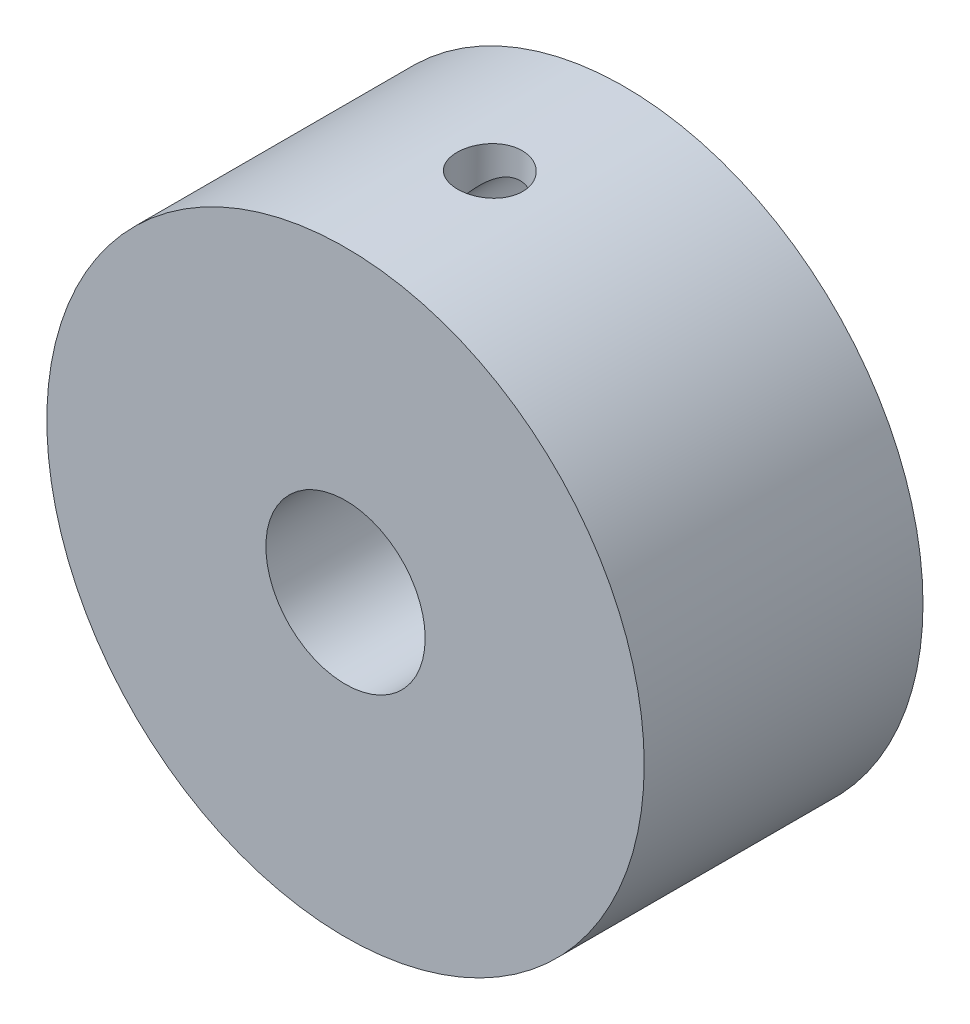
ISO-10303-21;
HEADER;
FILE_DESCRIPTION(('STEP AP214'),'2;1');
FILE_NAME('part.step','',(''),(''),'','','');
FILE_SCHEMA(('AUTOMOTIVE_DESIGN { 1 0 10303 214 1 1 1 1 }'));
ENDSEC;
DATA;
#1=APPLICATION_CONTEXT('core data for automotive mechanical design processes');
#2=APPLICATION_PROTOCOL_DEFINITION('international standard','automotive_design',2000,#1);
#3=PRODUCT_CONTEXT('',#1,'mechanical');
#4=PRODUCT('Part','Part','',(#3));
#5=PRODUCT_RELATED_PRODUCT_CATEGORY('part','',(#4));
#6=PRODUCT_DEFINITION_FORMATION('','',#4);
#7=PRODUCT_DEFINITION_CONTEXT('part definition',#1,'design');
#8=PRODUCT_DEFINITION('design','',#6,#7);
#9=PRODUCT_DEFINITION_SHAPE('','',#8);
#10=(LENGTH_UNIT() NAMED_UNIT(*) SI_UNIT(.MILLI.,.METRE.));
#11=(NAMED_UNIT(*) PLANE_ANGLE_UNIT() SI_UNIT($,.RADIAN.));
#12=(NAMED_UNIT(*) SI_UNIT($,.STERADIAN.) SOLID_ANGLE_UNIT());
#13=UNCERTAINTY_MEASURE_WITH_UNIT(LENGTH_MEASURE(1.E-05),#10,'distance_accuracy_value','');
#14=(GEOMETRIC_REPRESENTATION_CONTEXT(3) GLOBAL_UNCERTAINTY_ASSIGNED_CONTEXT((#13)) GLOBAL_UNIT_ASSIGNED_CONTEXT((#10,
#11,#12)) REPRESENTATION_CONTEXT('',''));
#15=CARTESIAN_POINT('',(0.,0.,0.));
#16=DIRECTION('',(0.,0.,1.));
#17=DIRECTION('',(1.,0.,0.));
#18=AXIS2_PLACEMENT_3D('',#15,#16,#17);
#19=CARTESIAN_POINT('',(0.,0.,14.));
#20=DIRECTION('',(0.,0.,1.));
#21=DIRECTION('',(1.,0.,0.));
#22=AXIS2_PLACEMENT_3D('',#19,#20,#21);
#23=PLANE('',#22);
#24=CARTESIAN_POINT('',(0.,0.,14.));
#25=DIRECTION('',(0.,0.,1.));
#26=DIRECTION('',(1.,0.,0.));
#27=AXIS2_PLACEMENT_3D('',#24,#25,#26);
#28=CIRCLE('',#27,15.);
#29=CARTESIAN_POINT('',(15.,0.,14.));
#30=VERTEX_POINT('',#29);
#31=EDGE_CURVE('E137',#30,#30,#28,.T.);
#32=ORIENTED_EDGE('',*,*,#31,.T.);
#33=EDGE_LOOP('',(#32));
#34=FACE_BOUND('',#33,.T.);
#35=CARTESIAN_POINT('',(0.,0.,14.));
#36=DIRECTION('',(0.,0.,1.));
#37=DIRECTION('',(1.,0.,0.));
#38=AXIS2_PLACEMENT_3D('',#35,#36,#37);
#39=CIRCLE('',#38,4.);
#40=CARTESIAN_POINT('',(4.,0.,14.));
#41=VERTEX_POINT('',#40);
#42=EDGE_CURVE('E131',#41,#41,#39,.T.);
#43=ORIENTED_EDGE('',*,*,#42,.F.);
#44=EDGE_LOOP('',(#43));
#45=FACE_BOUND('',#44,.T.);
#46=ADVANCED_FACE('F35',(#34,#45),#23,.T.);
#47=CARTESIAN_POINT('',(0.,0.,0.));
#48=DIRECTION('',(0.,0.,1.));
#49=DIRECTION('',(1.,0.,0.));
#50=AXIS2_PLACEMENT_3D('',#47,#48,#49);
#51=PLANE('',#50);
#52=CARTESIAN_POINT('',(0.,12.,0.));
#53=DIRECTION('',(0.,0.,-1.));
#54=DIRECTION('',(-1.,0.,0.));
#55=AXIS2_PLACEMENT_3D('',#52,#53,#54);
#56=CIRCLE('',#55,1.64999999999999);
#57=CARTESIAN_POINT('',(-1.64999999999999,12.,0.));
#58=VERTEX_POINT('',#57);
#59=EDGE_CURVE('E166',#58,#58,#56,.T.);
#60=ORIENTED_EDGE('',*,*,#59,.F.);
#61=EDGE_LOOP('',(#60));
#62=FACE_BOUND('',#61,.T.);
#63=CARTESIAN_POINT('',(12.,0.,0.));
#64=DIRECTION('',(0.,0.,-1.));
#65=DIRECTION('',(-1.,0.,0.));
#66=AXIS2_PLACEMENT_3D('',#63,#64,#65);
#67=CIRCLE('',#66,1.64999999999999);
#68=CARTESIAN_POINT('',(10.35,0.,0.));
#69=VERTEX_POINT('',#68);
#70=EDGE_CURVE('E161',#69,#69,#67,.T.);
#71=ORIENTED_EDGE('',*,*,#70,.F.);
#72=EDGE_LOOP('',(#71));
#73=FACE_BOUND('',#72,.T.);
#74=CARTESIAN_POINT('',(0.,-12.,0.));
#75=DIRECTION('',(0.,0.,-1.));
#76=DIRECTION('',(-1.,0.,0.));
#77=AXIS2_PLACEMENT_3D('',#74,#75,#76);
#78=CIRCLE('',#77,1.64999999999999);
#79=CARTESIAN_POINT('',(-1.64999999999999,-12.,0.));
#80=VERTEX_POINT('',#79);
#81=EDGE_CURVE('E171',#80,#80,#78,.T.);
#82=ORIENTED_EDGE('',*,*,#81,.F.);
#83=EDGE_LOOP('',(#82));
#84=FACE_BOUND('',#83,.T.);
#85=CARTESIAN_POINT('',(-12.,0.,0.));
#86=DIRECTION('',(0.,0.,-1.));
#87=DIRECTION('',(-1.,0.,0.));
#88=AXIS2_PLACEMENT_3D('',#85,#86,#87);
#89=CIRCLE('',#88,1.64999999999999);
#90=CARTESIAN_POINT('',(-13.65,0.,0.));
#91=VERTEX_POINT('',#90);
#92=EDGE_CURVE('E176',#91,#91,#89,.T.);
#93=ORIENTED_EDGE('',*,*,#92,.F.);
#94=EDGE_LOOP('',(#93));
#95=FACE_BOUND('',#94,.T.);
#96=CARTESIAN_POINT('',(0.,0.,0.));
#97=DIRECTION('',(0.,0.,1.));
#98=DIRECTION('',(1.,0.,0.));
#99=AXIS2_PLACEMENT_3D('',#96,#97,#98);
#100=CIRCLE('',#99,15.);
#101=CARTESIAN_POINT('',(15.,0.,0.));
#102=VERTEX_POINT('',#101);
#103=EDGE_CURVE('E134',#102,#102,#100,.T.);
#104=ORIENTED_EDGE('',*,*,#103,.F.);
#105=EDGE_LOOP('',(#104));
#106=FACE_BOUND('',#105,.T.);
#107=CARTESIAN_POINT('',(0.,0.,0.));
#108=DIRECTION('',(0.,0.,1.));
#109=DIRECTION('',(1.,0.,0.));
#110=AXIS2_PLACEMENT_3D('',#107,#108,#109);
#111=CIRCLE('',#110,4.);
#112=CARTESIAN_POINT('',(4.,0.,0.));
#113=VERTEX_POINT('',#112);
#114=EDGE_CURVE('E130',#113,#113,#111,.T.);
#115=ORIENTED_EDGE('',*,*,#114,.T.);
#116=EDGE_LOOP('',(#115));
#117=FACE_BOUND('',#116,.T.);
#118=ADVANCED_FACE('F98',(#62,#73,#84,#95,#106,#117),#51,.F.);
#119=CARTESIAN_POINT('',(0.,0.,14.));
#120=DIRECTION('',(0.,0.,-1.));
#121=DIRECTION('',(-1.,0.,0.));
#122=AXIS2_PLACEMENT_3D('',#119,#120,#121);
#123=CYLINDRICAL_SURFACE('',#122,15.);
#124=CARTESIAN_POINT('',(-1.40444402324851,14.9341065010787,7.));
#125=CARTESIAN_POINT('',(-1.40444002854332,14.9341076187197,6.90762008453076));
#126=CARTESIAN_POINT('',(-1.39664642195995,14.9348461643207,6.81518033398471));
#127=CARTESIAN_POINT('',(-1.36567714795439,14.9377092763975,6.63286737097806));
#128=CARTESIAN_POINT('',(-1.34248485681701,14.9398353407326,6.54299704183349));
#129=CARTESIAN_POINT('',(-1.28140840722337,14.9451974373308,6.36848927100874));
#130=CARTESIAN_POINT('',(-1.24353355291886,14.9484327665173,6.28384855469194));
#131=CARTESIAN_POINT('',(-1.15419112367343,14.9555956641134,6.12213270201396));
#132=CARTESIAN_POINT('',(-1.1027261074599,14.9595231021679,6.04505614523162));
#133=CARTESIAN_POINT('',(-0.987429681966631,14.9675758008409,5.90030252503362));
#134=CARTESIAN_POINT('',(-0.923550923134062,14.971701771881,5.83266321124539));
#135=CARTESIAN_POINT('',(-0.785349181748771,14.9795863546345,5.70902957679901));
#136=CARTESIAN_POINT('',(-0.711025706332219,14.9833449489979,5.6530358059785));
#137=CARTESIAN_POINT('',(-0.553817136150943,14.9899794007537,5.55415011403972));
#138=CARTESIAN_POINT('',(-0.470910717000259,14.992852985422,5.51129192672872));
#139=CARTESIAN_POINT('',(-0.299043635136632,14.9972648919364,5.44010988513696));
#140=CARTESIAN_POINT('',(-0.210083148797655,14.9988032526639,5.41178560764294));
#141=CARTESIAN_POINT('',(-0.0290210250710986,15.0002438882639,5.37058701380558));
#142=CARTESIAN_POINT('',(0.0630663709229489,15.0001527895024,5.35765035112213));
#143=CARTESIAN_POINT('',(0.248087169605128,14.9982335583394,5.34740118393402));
#144=CARTESIAN_POINT('',(0.341020546022559,14.9964054796964,5.35008819590007));
#145=CARTESIAN_POINT('',(0.524672235769409,14.9911015213442,5.37095973653297));
#146=CARTESIAN_POINT('',(0.615398387897877,14.9876327990671,5.38907722085952));
#147=CARTESIAN_POINT('',(0.792490496309464,14.9793131395984,5.4401908370904));
#148=CARTESIAN_POINT('',(0.878856385886247,14.974462181268,5.4731871965455));
#149=CARTESIAN_POINT('',(1.0449907887954,14.9637878028663,5.55319459863277));
#150=CARTESIAN_POINT('',(1.12474499763803,14.9579623525639,5.60023506437928));
#151=CARTESIAN_POINT('',(1.27524266176456,14.9458845444307,5.70697399601561));
#152=CARTESIAN_POINT('',(1.34598579684268,14.9396321714416,5.76667291151885));
#153=CARTESIAN_POINT('',(1.47685274988013,14.9272656045822,5.8974105946975));
#154=CARTESIAN_POINT('',(1.53691836235445,14.9211523175384,5.96850772630399));
#155=CARTESIAN_POINT('',(1.64428150794931,14.9097036439126,6.11982200127161));
#156=CARTESIAN_POINT('',(1.69157901556137,14.9043682588847,6.20003916285253));
#157=CARTESIAN_POINT('',(1.77207076643411,14.8950131137638,6.36736382343207));
#158=CARTESIAN_POINT('',(1.80526102154651,14.8909937257793,6.45447326264678));
#159=CARTESIAN_POINT('',(1.85655294251693,14.8846862581729,6.63308585137504));
#160=CARTESIAN_POINT('',(1.87465516712567,14.8823981144384,6.72458883805088));
#161=CARTESIAN_POINT('',(1.89518441477677,14.8797978648393,6.90887889420228));
#162=CARTESIAN_POINT('',(1.89769289942315,14.8794754899787,7.00165674860581));
#163=CARTESIAN_POINT('',(1.88717816221692,14.8808126649339,7.18631226067988));
#164=CARTESIAN_POINT('',(1.87415519523733,14.8824721822265,7.27818993309757));
#165=CARTESIAN_POINT('',(1.83301353314854,14.887595000238,7.45819661170016));
#166=CARTESIAN_POINT('',(1.80493370633131,14.8910536559155,7.54633464214434));
#167=CARTESIAN_POINT('',(1.73451106878761,14.8994201686875,7.71664130405737));
#168=CARTESIAN_POINT('',(1.69216786537095,14.9043280656813,7.79880977110028));
#169=CARTESIAN_POINT('',(1.5942119378388,14.9151237695677,7.95521584479917));
#170=CARTESIAN_POINT('',(1.53854539503511,14.9210155207108,8.02941947013615));
#171=CARTESIAN_POINT('',(1.41559270744761,14.9331813044703,8.16744410418427));
#172=CARTESIAN_POINT('',(1.3483062140299,14.939455348553,8.23126480126433));
#173=CARTESIAN_POINT('',(1.20366195957063,14.9518052212649,8.3469953716167));
#174=CARTESIAN_POINT('',(1.12626137958229,14.9578800614096,8.39885185421529));
#175=CARTESIAN_POINT('',(0.963789133091351,14.9692261945854,8.48881382867268));
#176=CARTESIAN_POINT('',(0.878717590651715,14.9744975006085,8.52691954287369));
#177=CARTESIAN_POINT('',(0.70349578051018,14.9837501268968,8.58820868907663));
#178=CARTESIAN_POINT('',(0.613356758297657,14.9877341806624,8.61142384614919));
#179=CARTESIAN_POINT('',(0.430405199263511,14.9941030041514,8.64237630697434));
#180=CARTESIAN_POINT('',(0.337592754608045,14.9964878289395,8.65011414366079));
#181=CARTESIAN_POINT('',(0.152450930160444,14.9995095276487,8.64988390908324));
#182=CARTESIAN_POINT('',(0.0601215859799333,15.0001555598669,8.64199850940513));
#183=CARTESIAN_POINT('',(-0.121919012431443,14.9997807913731,8.61091964712493));
#184=CARTESIAN_POINT('',(-0.211630265889659,14.9987599901691,8.58772618000517));
#185=CARTESIAN_POINT('',(-0.385880158014836,14.9952891077917,8.52671364489208));
#186=CARTESIAN_POINT('',(-0.470419856754322,14.9928393206258,8.48889758597173));
#187=CARTESIAN_POINT('',(-0.63198242084349,14.9868989908104,8.39972197074953));
#188=CARTESIAN_POINT('',(-0.709005279698305,14.9834084472616,8.34836240274566));
#189=CARTESIAN_POINT('',(-0.853765036312645,14.975859720852,8.23324894305901));
#190=CARTESIAN_POINT('',(-0.921452805094604,14.9717987461209,8.16943345063016));
#191=CARTESIAN_POINT('',(-1.04519325407501,14.963670237742,8.0313444562852));
#192=CARTESIAN_POINT('',(-1.10124315335921,14.9596027027602,7.95706846189108));
#193=CARTESIAN_POINT('',(-1.20024869115826,14.9519859437988,7.79991568588812));
#194=CARTESIAN_POINT('',(-1.24316423837559,14.9484383236482,7.71701358582599));
#195=CARTESIAN_POINT('',(-1.31438902778017,14.9423448935075,7.5451940816102));
#196=CARTESIAN_POINT('',(-1.34271452569699,14.9397979693306,7.45628349743709));
#197=CARTESIAN_POINT('',(-1.37699199425245,14.9366686355591,7.30573752239189));
#198=CARTESIAN_POINT('',(-1.3872721015408,14.9357130477709,7.24506011398443));
#199=CARTESIAN_POINT('',(-1.40099942693685,14.934431610327,7.12293063432609));
#200=CARTESIAN_POINT('',(-1.40444668171328,14.9341057572919,7.06147856723423));
#201=CARTESIAN_POINT('',(-1.40444402324851,14.9341065010787,7.));
#202=B_SPLINE_CURVE_WITH_KNOTS('',3,(#124,#125,#126,#127,#128,#129,#130,#131,#132,#133,#134,
#135,#136,#137,#138,#139,#140,#141,#142,#143,#144,#145,#146,#147,#148,#149,#150,#151,#152,#153,
#154,#155,#156,#157,#158,#159,#160,#161,#162,#163,#164,#165,#166,#167,#168,#169,#170,#171,#172,
#173,#174,#175,#176,#177,#178,#179,#180,#181,#182,#183,#184,#185,#186,#187,#188,#189,#190,#191,
#192,#193,#194,#195,#196,#197,#198,#199,#200,#201),.UNSPECIFIED.,.T.,.F.,(4,2,2,2,2,2,2,2,2,2,2,
2,2,2,2,2,2,2,2,2,2,2,2,2,2,2,2,2,2,2,2,2,2,2,2,2,2,2,4),(0.,0.276915207983226,
0.554129848078058,0.831169107214855,1.10815624312097,1.38622139272366,1.66429966803449,
1.94308621188646,2.2218646372861,2.49950964000064,2.77714605006441,3.0535822672665,
3.33002271230178,3.60704642746888,3.8840799838455,4.16258025681132,4.44108108616877,
4.71966059598153,4.99822978878066,5.27534250635454,5.5524506765374,5.82884692991708,
6.10525079348405,6.38279059615239,6.66033872730737,6.93910245036018,7.21786166575785,
7.49602498056473,7.77417871715013,8.05086451214976,8.3275503888039,8.60417935863116,
8.88080856747539,9.15884219031829,9.43694217411328,9.71588275341203,9.99451187080729,
10.1787991318223,10.3630854038513),.UNSPECIFIED.);
#203=CARTESIAN_POINT('',(-1.40444402324851,14.9341065010787,7.));
#204=VERTEX_POINT('',#203);
#205=EDGE_CURVE('E123',#204,#204,#202,.T.);
#206=ORIENTED_EDGE('',*,*,#205,.T.);
#207=EDGE_LOOP('',(#206));
#208=FACE_BOUND('',#207,.T.);
#209=ORIENTED_EDGE('',*,*,#31,.F.);
#210=EDGE_LOOP('',(#209));
#211=FACE_BOUND('',#210,.T.);
#212=ORIENTED_EDGE('',*,*,#103,.T.);
#213=EDGE_LOOP('',(#212));
#214=FACE_BOUND('',#213,.T.);
#215=ADVANCED_FACE('F37',(#208,#211,#214),#123,.T.);
#216=CARTESIAN_POINT('',(0.,0.,14.));
#217=DIRECTION('',(0.,0.,-1.));
#218=DIRECTION('',(-1.,0.,0.));
#219=AXIS2_PLACEMENT_3D('',#216,#217,#218);
#220=CYLINDRICAL_SURFACE('',#219,4.);
#221=CARTESIAN_POINT('',(-1.58981604196295,3.67048838068142,7.));
#222=CARTESIAN_POINT('',(-1.58980646244093,3.67049727480228,6.91190351977432));
#223=CARTESIAN_POINT('',(-1.5826635578135,3.6736124374301,6.82365956802641));
#224=CARTESIAN_POINT('',(-1.55436989800673,3.68566884599314,6.64971293892112));
#225=CARTESIAN_POINT('',(-1.53318075839549,3.69462605552499,6.5640178994024));
#226=CARTESIAN_POINT('',(-1.47776866669471,3.71713376454319,6.39799706186937));
#227=CARTESIAN_POINT('',(-1.44359812751236,3.73066576923698,6.3176511797814));
#228=CARTESIAN_POINT('',(-1.36336584120342,3.76072617693089,6.16381823316578));
#229=CARTESIAN_POINT('',(-1.31730707205218,3.7772538292196,6.09032945721597));
#230=CARTESIAN_POINT('',(-1.21162639337337,3.81250926432819,5.9477713121535));
#231=CARTESIAN_POINT('',(-1.15139551503421,3.831308161597,5.8791707442198));
#232=CARTESIAN_POINT('',(-1.02039528802123,3.86825836551181,5.75264522809124));
#233=CARTESIAN_POINT('',(-0.949621941479672,3.88640942323606,5.69472434852778));
#234=CARTESIAN_POINT('',(-0.795890808213077,3.92084329901225,5.58882862869814));
#235=CARTESIAN_POINT('',(-0.712543868322902,3.93701440111877,5.54137906729385));
#236=CARTESIAN_POINT('',(-0.538270360935391,3.96459706617593,5.4613298546783));
#237=CARTESIAN_POINT('',(-0.447347115174051,3.97601070193988,5.42872373565345));
#238=CARTESIAN_POINT('',(-0.265448465925677,3.99217261928914,5.38097929334378));
#239=CARTESIAN_POINT('',(-0.174713382166638,3.9972318351908,5.36503315207677));
#240=CARTESIAN_POINT('',(0.00826326774752002,4.00103637544626,5.34845334814483));
#241=CARTESIAN_POINT('',(0.100504221088819,3.99978420737498,5.347813604678));
#242=CARTESIAN_POINT('',(0.27801261837576,3.99125785408545,5.3614364961366));
#243=CARTESIAN_POINT('',(0.3633677468268,3.98434746108523,5.3748121837171));
#244=CARTESIAN_POINT('',(0.530412522485194,3.96556806245042,5.41456881744776));
#245=CARTESIAN_POINT('',(0.612101899287217,3.95369869167893,5.44095072129068));
#246=CARTESIAN_POINT('',(0.771001013264229,3.92583352866817,5.50628766172018));
#247=CARTESIAN_POINT('',(0.848123623515784,3.90977766906303,5.54542798992487));
#248=CARTESIAN_POINT('',(0.994860405852648,3.87504152433008,5.63499127918661));
#249=CARTESIAN_POINT('',(1.06447192969716,3.85636031887454,5.68541820050331));
#250=CARTESIAN_POINT('',(1.19935209790695,3.81665233237762,5.80018823902864));
#251=CARTESIAN_POINT('',(1.26398580106138,3.79555271353126,5.86525341089873));
#252=CARTESIAN_POINT('',(1.38170388720581,3.75430331704946,6.00540966632158));
#253=CARTESIAN_POINT('',(1.43478398959945,3.73415389361888,6.08050444926331));
#254=CARTESIAN_POINT('',(1.52948606306233,3.6963983112342,6.24159840354732));
#255=CARTESIAN_POINT('',(1.57069197889568,3.67889289099701,6.32786757169265));
#256=CARTESIAN_POINT('',(1.63782080161317,3.64950705331953,6.5070466714059));
#257=CARTESIAN_POINT('',(1.66375438257051,3.63762270836824,6.59995191387382));
#258=CARTESIAN_POINT('',(1.69804015120237,3.62173942944129,6.78342289518499));
#259=CARTESIAN_POINT('',(1.70741060883268,3.61728482662084,6.87375830118286));
#260=CARTESIAN_POINT('',(1.71129625337102,3.61544933049896,7.0548056296986));
#261=CARTESIAN_POINT('',(1.70581641187825,3.61806606984512,7.14551741605928));
#262=CARTESIAN_POINT('',(1.68108140260484,3.62961808510428,7.31880100904947));
#263=CARTESIAN_POINT('',(1.66270423020237,3.63815023833549,7.40152817967461));
#264=CARTESIAN_POINT('',(1.61384234583599,3.66008533889005,7.56263706437997));
#265=CARTESIAN_POINT('',(1.58335484106456,3.67348940968327,7.64101777135166));
#266=CARTESIAN_POINT('',(1.50970040984389,3.70438367955162,7.79487900569563));
#267=CARTESIAN_POINT('',(1.46605551015834,3.72202162227979,7.87010019477924));
#268=CARTESIAN_POINT('',(1.36777952051961,3.75924692096166,8.01246016942973));
#269=CARTESIAN_POINT('',(1.31314374424889,3.77883510665931,8.07959548773512));
#270=CARTESIAN_POINT('',(1.18929111484986,3.81970708341666,8.20942962644671));
#271=CARTESIAN_POINT('',(1.11926049639492,3.84100190139087,8.27135173704871));
#272=CARTESIAN_POINT('',(0.969301641532709,3.88155649562033,8.38264285566206));
#273=CARTESIAN_POINT('',(0.889372765652602,3.90081614024492,8.43201105200319));
#274=CARTESIAN_POINT('',(0.721372101871564,3.93535007552759,8.51670413420678));
#275=CARTESIAN_POINT('',(0.633285856516393,3.95061709959514,8.55200347500272));
#276=CARTESIAN_POINT('',(0.451619909880242,3.9754777461642,8.60699165685874));
#277=CARTESIAN_POINT('',(0.358043439820611,3.98507466965182,8.62668958293893));
#278=CARTESIAN_POINT('',(0.174985446032786,3.99715068977726,8.64878822892048));
#279=CARTESIAN_POINT('',(0.0856645698286933,4.00007369725103,8.65228482874193));
#280=CARTESIAN_POINT('',(-0.0923540524164997,3.99992350602874,8.64481456562971));
#281=CARTESIAN_POINT('',(-0.181051901341907,3.99685132188615,8.63385015000454));
#282=CARTESIAN_POINT('',(-0.352172534308848,3.98535888728081,8.59855535786443));
#283=CARTESIAN_POINT('',(-0.434706190218118,3.97712538456091,8.57469555788544));
#284=CARTESIAN_POINT('',(-0.594644275210824,3.95637558425535,8.51479588512));
#285=CARTESIAN_POINT('',(-0.67204771668366,3.94385846487849,8.47875367521331));
#286=CARTESIAN_POINT('',(-0.82334762057357,3.91513667262231,8.3936954733136));
#287=CARTESIAN_POINT('',(-0.896929630959518,3.89879143243499,8.34416874322707));
#288=CARTESIAN_POINT('',(-1.03507915419115,3.86441293567084,8.23429715321));
#289=CARTESIAN_POINT('',(-1.09964338852212,3.84637906913441,8.17394837691919));
#290=CARTESIAN_POINT('',(-1.22236098484973,3.8092275693574,8.03941247264534));
#291=CARTESIAN_POINT('',(-1.27980320469105,3.79011755455778,7.96457224311506));
#292=CARTESIAN_POINT('',(-1.38137352194622,3.75429352035466,7.80573402431893));
#293=CARTESIAN_POINT('',(-1.42549426059348,3.73758082789425,7.72173100829041));
#294=CARTESIAN_POINT('',(-1.49861664820751,3.70886633476414,7.5472715587301));
#295=CARTESIAN_POINT('',(-1.52771522808782,3.6968344584787,7.4568608919089));
#296=CARTESIAN_POINT('',(-1.56984346195599,3.6791488658057,7.27195285592164));
#297=CARTESIAN_POINT('',(-1.58292701682418,3.67347376029552,7.17747030912312));
#298=CARTESIAN_POINT('',(-1.58912312489978,3.67078716093176,7.05513668635735));
#299=CARTESIAN_POINT('',(-1.58981904050225,3.67048559668333,7.02757556771498));
#300=CARTESIAN_POINT('',(-1.58981604196295,3.67048838068142,7.));
#301=B_SPLINE_CURVE_WITH_KNOTS('',3,(#221,#222,#223,#224,#225,#226,#227,#228,#229,#230,#231,
#232,#233,#234,#235,#236,#237,#238,#239,#240,#241,#242,#243,#244,#245,#246,#247,#248,#249,#250,
#251,#252,#253,#254,#255,#256,#257,#258,#259,#260,#261,#262,#263,#264,#265,#266,#267,#268,#269,
#270,#271,#272,#273,#274,#275,#276,#277,#278,#279,#280,#281,#282,#283,#284,#285,#286,#287,#288,
#289,#290,#291,#292,#293,#294,#295,#296,#297,#298,#299,#300),.UNSPECIFIED.,.T.,.F.,(4,2,2,2,2,2,
2,2,2,2,2,2,2,2,2,2,2,2,2,2,2,2,2,2,2,2,2,2,2,2,2,2,2,2,2,2,2,2,2,4),(0.,0.264211724660744,
0.529148459018595,0.793026677872045,1.05683885985755,1.33523297260791,1.61373292676209,
1.90403076094907,2.19420198072698,2.46953816244269,2.74476495901023,3.00356896819765,
3.2623920368679,3.52515526924738,3.78801084539544,4.06907613148063,4.35024537535723,
4.64031806272421,4.93018777241109,5.20152035698261,5.4727621157604,5.72713321026164,
5.98156300028878,6.24665916965706,6.51186861189121,6.79815687284344,7.0844636389886,
7.37128791456167,7.65794504349147,7.92489841526076,8.19180661499932,8.44957452423756,
8.70739191275384,8.97680852354691,9.24632283025303,9.53374725602171,9.82133016535512,
10.1070334851925,10.3917725616093,10.4744749384331),.UNSPECIFIED.);
#302=CARTESIAN_POINT('',(-1.58981604196295,3.67048838068142,7.));
#303=VERTEX_POINT('',#302);
#304=EDGE_CURVE('E117',#303,#303,#301,.T.);
#305=ORIENTED_EDGE('',*,*,#304,.F.);
#306=EDGE_LOOP('',(#305));
#307=FACE_BOUND('',#306,.T.);
#308=ORIENTED_EDGE('',*,*,#42,.T.);
#309=EDGE_LOOP('',(#308));
#310=FACE_BOUND('',#309,.T.);
#311=ORIENTED_EDGE('',*,*,#114,.F.);
#312=EDGE_LOOP('',(#311));
#313=FACE_BOUND('',#312,.T.);
#314=ADVANCED_FACE('F108',(#307,#310,#313),#220,.F.);
#315=CARTESIAN_POINT('',(0.246830437981668,14.9979690203336,7.));
#316=DIRECTION('',(0.0164553625321112,0.999864601355572,0.));
#317=DIRECTION('',(-0.999864601355572,0.0164553625321112,0.));
#318=AXIS2_PLACEMENT_3D('',#315,#316,#317);
#319=CYLINDRICAL_SURFACE('',#318,1.64999999999999);
#320=CARTESIAN_POINT('',(1.57037880328364,12.7915173483759,7.934761));
#321=CARTESIAN_POINT('',(1.55837753111781,12.7540287609515,7.95133042182838));
#322=CARTESIAN_POINT('',(1.54606498592105,12.7165407953792,7.96767928633487));
#323=CARTESIAN_POINT('',(1.52102068748946,12.6413691640807,7.99972931920313));
#324=CARTESIAN_POINT('',(1.50828843837045,12.6036853146555,8.01542966813464));
#325=CARTESIAN_POINT('',(1.48192654988926,12.5259156377608,8.04678112943109));
#326=CARTESIAN_POINT('',(1.46828633456038,12.4858126130585,8.06238111107631));
#327=CARTESIAN_POINT('',(1.44135790320707,12.4049538436613,8.09207507033603));
#328=CARTESIAN_POINT('',(1.42806948585228,12.364198494696,8.10616992397303));
#329=CARTESIAN_POINT('',(1.4023253499056,12.2796737311718,8.13254830774907));
#330=CARTESIAN_POINT('',(1.38993147081267,12.2358504523603,8.14472565362415));
#331=CARTESIAN_POINT('',(1.36925184621206,12.1470060635611,8.16434596481974));
#332=CARTESIAN_POINT('',(1.36088724312767,12.1020278006378,8.17188069020659));
#333=CARTESIAN_POINT('',(1.35195045390325,12.0183141993108,8.179326133261));
#334=CARTESIAN_POINT('',(1.35029828292749,11.9798119911988,8.18031212132568));
#335=CARTESIAN_POINT('',(1.35229867653673,11.9025022014653,8.17710503722144));
#336=CARTESIAN_POINT('',(1.35604978582909,11.8637021148181,8.17281596890405));
#337=CARTESIAN_POINT('',(1.37074358213816,11.7640192491677,8.15646221593008));
#338=CARTESIAN_POINT('',(1.3846878655676,11.7042063700937,8.14124014713409));
#339=CARTESIAN_POINT('',(1.41566861238252,11.5866520882058,8.10586363430017));
#340=CARTESIAN_POINT('',(1.43272926174074,11.5289314461922,8.08567014813502));
#341=CARTESIAN_POINT('',(1.46593642745918,11.4183590342913,8.04417492905707));
#342=CARTESIAN_POINT('',(1.48206721692755,11.3654409712549,8.02303917523804));
#343=CARTESIAN_POINT('',(1.51351188543871,11.260770337961,7.97962206959735));
#344=CARTESIAN_POINT('',(1.52883407574727,11.2090118547068,7.95736107170151));
#345=CARTESIAN_POINT('',(1.54348246943651,11.1572359967792,7.934761));
#346=B_SPLINE_CURVE_WITH_KNOTS('',3,(#320,#321,#322,#323,#324,#325,#326,#327,#328,#329,#330,
#331,#332,#333,#334,#335,#336,#337,#338,#339,#340,#341,#342,#343,#344,#345),.UNSPECIFIED.,.F.,
.F.,(4,2,2,2,2,2,2,2,2,2,2,2,4),(0.,0.128124575162063,0.256406376574717,0.391810472674667,
0.527135325629765,0.668378882027924,0.806732854721003,0.921650136917073,1.03868999739414,
1.2275978055437,1.41803933939084,1.59566754616408,1.77079129774702),.UNSPECIFIED.);
#347=CARTESIAN_POINT('',(1.52064892200283,12.640411473985,8.));
#348=VERTEX_POINT('',#347);
#349=CARTESIAN_POINT('',(1.49875185031607,11.3098964634388,7.99999999999999));
#350=VERTEX_POINT('',#349);
#351=EDGE_CURVE('E49',#348,#350,#346,.T.);
#352=ORIENTED_EDGE('',*,*,#351,.T.);
#353=CARTESIAN_POINT('',(1.49875185031606,11.3098964634389,8.));
#354=CARTESIAN_POINT('',(1.50987834695968,11.3340683547008,7.98592366893068));
#355=CARTESIAN_POINT('',(1.52047384121879,11.3586106705316,7.97207618920313));
#356=CARTESIAN_POINT('',(1.54058724210711,11.4085450342016,7.94505138171585));
#357=CARTESIAN_POINT('',(1.55010350160243,11.4339383062534,7.93187509477579));
#358=CARTESIAN_POINT('',(1.57727984370246,11.5123648121565,7.89328446121979));
#359=CARTESIAN_POINT('',(1.59316887981385,11.5667908823464,7.86932610173375));
#360=CARTESIAN_POINT('',(1.61731088547609,11.6697151758269,7.83192077562593));
#361=CARTESIAN_POINT('',(1.62641102987359,11.7175997781998,7.81737064872256));
#362=CARTESIAN_POINT('',(1.64035960513186,11.8152707677414,7.79534798757596));
#363=CARTESIAN_POINT('',(1.64524103298552,11.8650391576053,7.78782048777076));
#364=CARTESIAN_POINT('',(1.65042526975803,11.9658936462626,7.78130816807922));
#365=CARTESIAN_POINT('',(1.65068387181736,12.016987792989,7.78240568396979));
#366=CARTESIAN_POINT('',(1.64654532607024,12.1182147784999,7.79307841974428));
#367=CARTESIAN_POINT('',(1.64212994682729,12.1683430705704,7.80268681340315));
#368=CARTESIAN_POINT('',(1.62692127284379,12.2828674536879,7.83273389084562));
#369=CARTESIAN_POINT('',(1.61447211281043,12.3463326986907,7.85574133054924));
#370=CARTESIAN_POINT('',(1.58328271254433,12.4687526535443,7.90822778591295));
#371=CARTESIAN_POINT('',(1.56453420639946,12.5277013113317,7.93771528693738));
#372=CARTESIAN_POINT('',(1.53581759861549,12.6034566932443,7.97903672828244));
#373=CARTESIAN_POINT('',(1.52838265308501,12.6220368601734,7.98946185219347));
#374=CARTESIAN_POINT('',(1.52064892200284,12.640411473985,8.00000000000001));
#375=B_SPLINE_CURVE_WITH_KNOTS('',3,(#353,#354,#355,#356,#357,#358,#359,#360,#361,#362,#363,
#364,#365,#366,#367,#368,#369,#370,#371,#372,#373,#374),.UNSPECIFIED.,.F.,.F.,(4,2,2,2,2,2,2,2,
2,2,4),(0.,0.0902867662783749,0.180709525254997,0.364765587050817,0.516834648081535,
0.667703237302929,0.820013779257809,0.972920623920913,1.17771585356767,1.38278086896785,
1.4504545485789),.UNSPECIFIED.);
#376=EDGE_CURVE('E11',#350,#348,#375,.T.);
#377=ORIENTED_EDGE('',*,*,#376,.T.);
#378=EDGE_LOOP('',(#352,#377));
#379=FACE_BOUND('',#378,.T.);
#380=CARTESIAN_POINT('',(-1.18377306330174,10.6995113867535,7.93476099999997));
#381=CARTESIAN_POINT('',(-1.16716144866557,10.7366943529243,7.95800604867694));
#382=CARTESIAN_POINT('',(-1.1496529416402,10.7734569367368,7.98133539056249));
#383=CARTESIAN_POINT('',(-1.11241253389523,10.845890148121,8.0282973562395));
#384=CARTESIAN_POINT('',(-1.09267167784939,10.8815555908978,8.05193083842816));
#385=CARTESIAN_POINT('',(-1.04986247338625,10.9525653889364,8.10035557155362));
#386=CARTESIAN_POINT('',(-1.02669541731553,10.987844754262,8.12515641692144));
#387=CARTESIAN_POINT('',(-0.977132803401664,11.0557936087485,8.1749865349017));
#388=CARTESIAN_POINT('',(-0.950742791603408,11.0884674256936,8.20001534839842));
#389=CARTESIAN_POINT('',(-0.890095224828933,11.1544253983745,8.25374259063153));
#390=CARTESIAN_POINT('',(-0.855254274410256,11.1871679243123,8.28246938234414));
#391=CARTESIAN_POINT('',(-0.780109097075963,11.2450782273302,8.33915067918655));
#392=CARTESIAN_POINT('',(-0.73988854542812,11.2703460059857,8.36711036399231));
#393=CARTESIAN_POINT('',(-0.653529976830868,11.3119718671294,8.42132550945944));
#394=CARTESIAN_POINT('',(-0.607351003634014,11.3282637326957,8.44756707809546));
#395=CARTESIAN_POINT('',(-0.510617999228235,11.3527801817407,8.49637465466128));
#396=CARTESIAN_POINT('',(-0.460023977112944,11.3609203682264,8.51890023325193));
#397=CARTESIAN_POINT('',(-0.366026857966598,11.3721641549656,8.5551930045345));
#398=CARTESIAN_POINT('',(-0.323004688137394,11.3759173012511,8.569808736028));
#399=CARTESIAN_POINT('',(-0.235865552208519,11.383488837155,8.59546132971311));
#400=CARTESIAN_POINT('',(-0.191747822472655,11.3873072716688,8.60649561560799));
#401=CARTESIAN_POINT('',(-0.103318888164859,11.3971859326686,8.62478307529267));
#402=CARTESIAN_POINT('',(-0.0590119442365158,11.4032282655437,8.63206534526783));
#403=CARTESIAN_POINT('',(0.0293324748057714,11.4191444490565,8.64296015156865));
#404=CARTESIAN_POINT('',(0.0733702439928868,11.4290128261436,8.64657790377439));
#405=CARTESIAN_POINT('',(0.165999638107759,11.4551793952606,8.65057231325564));
#406=CARTESIAN_POINT('',(0.214427330937234,11.4721531435217,8.65045946130702));
#407=CARTESIAN_POINT('',(0.308404059460686,11.5128877562539,8.64637388527893));
#408=CARTESIAN_POINT('',(0.35394228040316,11.5366724704735,8.64238747779006));
#409=CARTESIAN_POINT('',(0.433335953883632,11.5866191195109,8.63246622832666));
#410=CARTESIAN_POINT('',(0.467887327544375,11.6117665770891,8.62695330954788));
#411=CARTESIAN_POINT('',(0.532584970232283,11.6669377188904,8.61480065696382));
#412=CARTESIAN_POINT('',(0.562743820991123,11.6969469340705,8.60816426416568));
#413=CARTESIAN_POINT('',(0.604911093893737,11.7480712970804,8.59793591250411));
#414=CARTESIAN_POINT('',(0.619105593015313,11.7673714444674,8.59427625677082));
#415=CARTESIAN_POINT('',(0.644774246224861,11.8077937896555,8.58739397726196));
#416=CARTESIAN_POINT('',(0.656251875826438,11.8289136119454,8.58417079741609));
#417=CARTESIAN_POINT('',(0.673608227148467,11.8685686099988,8.57919953469408));
#418=CARTESIAN_POINT('',(0.68014514999474,11.8867898198198,8.5772858223267));
#419=CARTESIAN_POINT('',(0.690230407140001,11.924103511429,8.57434645708865));
#420=CARTESIAN_POINT('',(0.693784196610619,11.9431943352545,8.57331918311646));
#421=CARTESIAN_POINT('',(0.697491319241697,11.9818556608259,8.57234603567215));
#422=CARTESIAN_POINT('',(0.697624686444953,12.001428311749,8.57240650819543));
#423=CARTESIAN_POINT('',(0.694456752688415,12.0402636997132,8.57361157126548));
#424=CARTESIAN_POINT('',(0.691151701838434,12.0595260750838,8.57475734530465));
#425=CARTESIAN_POINT('',(0.680564694014903,12.1011301116422,8.57824218656867));
#426=CARTESIAN_POINT('',(0.672596990438479,12.1232759680908,8.58078031203491));
#427=CARTESIAN_POINT('',(0.653353790978026,12.1659760877766,8.58661146168095));
#428=CARTESIAN_POINT('',(0.642069571210692,12.1865259703475,8.58990647173949));
#429=CARTESIAN_POINT('',(0.609579407350733,12.2377826084953,8.59886951739733));
#430=CARTESIAN_POINT('',(0.586471305603923,12.267231631388,8.60478017949118));
#431=CARTESIAN_POINT('',(0.536035083971946,12.3223166540276,8.61622457324392));
#432=CARTESIAN_POINT('',(0.508697763538295,12.347944095446,8.62175744427392));
#433=CARTESIAN_POINT('',(0.440399305821997,12.4041591172145,8.633501574057));
#434=CARTESIAN_POINT('',(0.398078610213233,12.4332063615467,8.6392388483937));
#435=CARTESIAN_POINT('',(0.309360147683534,12.4845533593491,8.64734074906294));
#436=CARTESIAN_POINT('',(0.262968326716091,12.5068627486822,8.64971020989237));
#437=CARTESIAN_POINT('',(0.167283208857798,12.5450672466066,8.65024095328607));
#438=CARTESIAN_POINT('',(0.117973908691501,12.5609223105716,8.6483764224253));
#439=CARTESIAN_POINT('',(0.0181379639834945,12.5869567741968,8.63991635930999));
#440=CARTESIAN_POINT('',(-0.0323924774490738,12.5971151754286,8.63330352588972));
#441=CARTESIAN_POINT('',(-0.126896147539097,12.6126340517783,8.61638032908483));
#442=CARTESIAN_POINT('',(-0.170905715333255,12.6184331975299,8.60662995888491));
#443=CARTESIAN_POINT('',(-0.258139460955941,12.629148828886,8.58349736009382));
#444=CARTESIAN_POINT('',(-0.301362160870198,12.6340637821986,8.57010892567014));
#445=CARTESIAN_POINT('',(-0.386032975041327,12.645453944357,8.53999732345639));
#446=CARTESIAN_POINT('',(-0.427493039624283,12.65191555301,8.52330343119027));
#447=CARTESIAN_POINT('',(-0.508148109641435,12.6689299920666,8.48694809575587));
#448=CARTESIAN_POINT('',(-0.547348961332882,12.679471662656,8.46729483589066));
#449=CARTESIAN_POINT('',(-0.632332982059462,12.7099296720267,8.42038752833441));
#450=CARTESIAN_POINT('',(-0.677171661406822,12.7315724719159,8.3924869606932));
#451=CARTESIAN_POINT('',(-0.760442244389535,12.7838816678605,8.33523950169855));
#452=CARTESIAN_POINT('',(-0.79883872263217,12.814595549255,8.30588569348667));
#453=CARTESIAN_POINT('',(-0.885215213751641,12.8973024158412,8.23405811279991));
#454=CARTESIAN_POINT('',(-0.929835966313022,12.9526774293352,8.19156957695572));
#455=CARTESIAN_POINT('',(-1.00969700039366,13.0702798079547,8.10734378545883));
#456=CARTESIAN_POINT('',(-1.04490608046286,13.1325290218226,8.06560944615878));
#457=CARTESIAN_POINT('',(-1.0881382102053,13.2199600011448,8.00918401445361));
#458=CARTESIAN_POINT('',(-1.0991973655914,13.2435077383666,7.99419295258097));
#459=CARTESIAN_POINT('',(-1.12040694864455,13.2908918182458,7.96437768065663));
#460=CARTESIAN_POINT('',(-1.13056235319626,13.314725638172,7.94955300802269));
#461=CARTESIAN_POINT('',(-1.14033775350366,13.3387378782022,7.93476099999727));
#462=B_SPLINE_CURVE_WITH_KNOTS('',3,(#380,#381,#382,#383,#384,#385,#386,#387,#388,#389,#390,
#391,#392,#393,#394,#395,#396,#397,#398,#399,#400,#401,#402,#403,#404,#405,#406,#407,#408,#409,
#410,#411,#412,#413,#414,#415,#416,#417,#418,#419,#420,#421,#422,#423,#424,#425,#426,#427,#428,
#429,#430,#431,#432,#433,#434,#435,#436,#437,#438,#439,#440,#441,#442,#443,#444,#445,#446,#447,
#448,#449,#450,#451,#452,#453,#454,#455,#456,#457,#458,#459,#460,#461),.UNSPECIFIED.,.F.,.F.,(4,
2,2,2,2,2,2,2,2,2,2,2,2,2,2,2,2,2,2,2,2,2,2,2,2,2,2,2,2,2,2,2,2,2,2,2,2,2,2,2,4),(0.,
0.140703626298546,0.281993189434587,0.428711472401199,0.575180749567807,0.741925682943468,
0.906326852455514,1.07192513150752,1.23922070791426,1.37586396117447,1.51260529141116,
1.64826962349013,1.78374058566775,1.93705008591092,2.09090313113696,2.21975332455782,
2.3482268638691,2.42077393975014,2.49322770320534,2.55136394180309,2.60939363526264,
2.66776198758599,2.72619406240687,2.79681461453413,2.86762261793113,2.98068932003766,
3.0940055473009,3.24815481085422,3.4020825688513,3.55695129767614,3.71238719657501,
3.84855427028523,3.98495509278211,4.12019792598352,4.25507342683821,4.42507428591715,
4.59598133502548,4.84308411666565,5.09099620645924,5.18106350627059,5.27059936731239),.UNSPECIFIED.);
#463=CARTESIAN_POINT('',(-1.13483942703489,10.802235634673,8.));
#464=VERTEX_POINT('',#463);
#465=CARTESIAN_POINT('',(-1.09481088936412,13.2344590380121,8.));
#466=VERTEX_POINT('',#465);
#467=EDGE_CURVE('E139',#464,#466,#462,.T.);
#468=ORIENTED_EDGE('',*,*,#467,.T.);
#469=CARTESIAN_POINT('',(-1.09481088936412,13.2344590380121,8.));
#470=CARTESIAN_POINT('',(-1.12190195157335,13.2104448872129,7.96494490567995));
#471=CARTESIAN_POINT('',(-1.14751924829836,13.1861209633443,7.92896408632962));
#472=CARTESIAN_POINT('',(-1.19584540808326,13.1373768443772,7.85503639383074));
#473=CARTESIAN_POINT('',(-1.21854874270236,13.1129565543096,7.81708596992884));
#474=CARTESIAN_POINT('',(-1.26140877240022,13.0641541821747,7.73845724020295));
#475=CARTESIAN_POINT('',(-1.28150549974482,13.0397826187569,7.69773957316434));
#476=CARTESIAN_POINT('',(-1.3185069159052,12.9924416407227,7.61414225257514));
#477=CARTESIAN_POINT('',(-1.33541459929269,12.9694709245417,7.57126467565427));
#478=CARTESIAN_POINT('',(-1.36731714370607,12.9240038906571,7.47888105320135));
#479=CARTESIAN_POINT('',(-1.38197903232639,12.9017586891943,7.4291318796385));
#480=CARTESIAN_POINT('',(-1.40671829600271,12.8626582656485,7.32667292533733));
#481=CARTESIAN_POINT('',(-1.41682002681055,12.8457745550272,7.27398060383963));
#482=CARTESIAN_POINT('',(-1.43045411172242,12.8224684721413,7.17543778798301));
#483=CARTESIAN_POINT('',(-1.43483412771257,12.8147213566348,7.13003247078357));
#484=CARTESIAN_POINT('',(-1.43965374825664,12.8061794546803,7.03837858358093));
#485=CARTESIAN_POINT('',(-1.44009840351722,12.8053757569673,6.99213117079087));
#486=CARTESIAN_POINT('',(-1.43701284307269,12.8108639795956,6.90029564969296));
#487=CARTESIAN_POINT('',(-1.43348885728408,12.8171447788184,6.85470662150621));
#488=CARTESIAN_POINT('',(-1.42280380393878,12.8356081437238,6.76514733592652));
#489=CARTESIAN_POINT('',(-1.41563432333824,12.8478043579373,6.72118107641802));
#490=CARTESIAN_POINT('',(-1.39175720831975,12.8867513660379,6.6042858449389));
#491=CARTESIAN_POINT('',(-1.37190176401743,12.9176476576196,6.53342336177187));
#492=CARTESIAN_POINT('',(-1.32418840736557,12.9852706104337,6.39731425626468));
#493=CARTESIAN_POINT('',(-1.29629620588813,13.0220219455027,6.33209328771515));
#494=CARTESIAN_POINT('',(-1.24083935205566,13.0882113207278,6.22204796446316));
#495=CARTESIAN_POINT('',(-1.21487975654729,13.1172262285442,6.17615095680505));
#496=CARTESIAN_POINT('',(-1.15876425300355,13.175330013953,6.08704227188049));
#497=CARTESIAN_POINT('',(-1.12860630245208,13.2044189207429,6.04383191657296));
#498=CARTESIAN_POINT('',(-1.03190466093611,13.2903793535933,5.91840342560469));
#499=CARTESIAN_POINT('',(-0.958986959540907,13.3461306655411,5.84009753015841));
#500=CARTESIAN_POINT('',(-0.819221465939916,13.4339242411941,5.7168364379072));
#501=CARTESIAN_POINT('',(-0.75653426101469,13.4682024779954,5.66872648805793));
#502=CARTESIAN_POINT('',(-0.622580787034976,13.5298038200286,5.58064136673907));
#503=CARTESIAN_POINT('',(-0.55132762288006,13.5571373552741,5.54065401454336));
#504=CARTESIAN_POINT('',(-0.414121332715241,13.5985064357915,5.4767358116042));
#505=CARTESIAN_POINT('',(-0.349353635239249,13.6140183726292,5.45122755185687));
#506=CARTESIAN_POINT('',(-0.215838202891333,13.6372211140087,5.40827441602058));
#507=CARTESIAN_POINT('',(-0.147092869782047,13.644916587231,5.39082473004233));
#508=CARTESIAN_POINT('',(-0.00717021750131497,13.6514758296913,5.36481226061465));
#509=CARTESIAN_POINT('',(0.0640167787246378,13.6502990841454,5.35629044781142));
#510=CARTESIAN_POINT('',(0.206127900475031,13.6386250337105,5.34856462277921));
#511=CARTESIAN_POINT('',(0.277052049387065,13.6281285790857,5.34935976061849));
#512=CARTESIAN_POINT('',(0.411123526304381,13.5993225542209,5.35937847512158));
#513=CARTESIAN_POINT('',(0.474458246118278,13.5816476397484,5.3679748995949));
#514=CARTESIAN_POINT('',(0.597438813476657,13.5394157523966,5.39184091688167));
#515=CARTESIAN_POINT('',(0.657083463790747,13.5148565600832,5.40711266265313));
#516=CARTESIAN_POINT('',(0.790723591491534,13.450661183505,5.44922453237949));
#517=CARTESIAN_POINT('',(0.862935739616805,13.4087251847327,5.47822052776864));
#518=CARTESIAN_POINT('',(0.998136763132669,13.3164187119425,5.54342068754892));
#519=CARTESIAN_POINT('',(1.06110604068908,13.266030788054,5.57963979464463));
#520=CARTESIAN_POINT('',(1.19576387275214,13.1416968964184,5.66886423591411));
#521=CARTESIAN_POINT('',(1.2640652251061,13.0653001090287,5.72358534380541));
#522=CARTESIAN_POINT('',(1.35456482810812,12.9435124059929,5.80774336758335));
#523=CARTESIAN_POINT('',(1.38275942676184,12.9016765264968,5.83616883333992));
#524=CARTESIAN_POINT('',(1.4352205985863,12.8155854163917,5.89297382472111));
#525=CARTESIAN_POINT('',(1.45948880694321,12.7713312032482,5.92135336457184));
#526=CARTESIAN_POINT('',(1.51086580114926,12.6664576717407,5.98564459672492));
#527=CARTESIAN_POINT('',(1.53659635018027,12.6049522755966,6.02122415445749));
#528=CARTESIAN_POINT('',(1.58097677362547,12.4770541274526,6.08771105313253));
#529=CARTESIAN_POINT('',(1.59964249506778,12.4106727173152,6.11862875609267));
#530=CARTESIAN_POINT('',(1.6239885787127,12.2955659922283,6.1618923432584));
#531=CARTESIAN_POINT('',(1.63192446216291,12.2483861472186,6.17698919588096));
#532=CARTESIAN_POINT('',(1.64369950200923,12.1519733318511,6.20064925818066));
#533=CARTESIAN_POINT('',(1.64755108138435,12.1027470634484,6.20923225787063));
#534=CARTESIAN_POINT('',(1.65075784720314,12.0028855987881,6.21816948268282));
#535=CARTESIAN_POINT('',(1.65007085171771,11.9522415535901,6.21844637844938));
#536=CARTESIAN_POINT('',(1.64411024648227,11.8518734600688,6.21049555860883));
#537=CARTESIAN_POINT('',(1.6388288558177,11.8021511186843,6.20225341097615));
#538=CARTESIAN_POINT('',(1.62201920221337,11.690817281201,6.17566103533107));
#539=CARTESIAN_POINT('',(1.60911584312705,11.6299808594729,6.15505979305812));
#540=CARTESIAN_POINT('',(1.57752212435903,11.512500236543,6.1071845086993));
#541=CARTESIAN_POINT('',(1.55880719899189,11.4558751204463,6.07988224585411));
#542=CARTESIAN_POINT('',(1.51883238153519,11.353247537953,6.02543960313514));
#543=CARTESIAN_POINT('',(1.4981695775188,11.3067955929842,5.99869321040643));
#544=CARTESIAN_POINT('',(1.45301945637706,11.2165584486964,5.94393540634805));
#545=CARTESIAN_POINT('',(1.42852950335048,11.1727751164577,5.91592313268159));
#546=CARTESIAN_POINT('',(1.3494072029543,11.0452081203806,5.83154627422771));
#547=CARTESIAN_POINT('',(1.28907912188282,10.9650980442545,5.77477801331545));
#548=CARTESIAN_POINT('',(1.16379053877011,10.8272578954432,5.67461378264115));
#549=CARTESIAN_POINT('',(1.10106648621109,10.7679914642689,5.63052186423351));
#550=CARTESIAN_POINT('',(0.964563224592888,10.6584557369343,5.5487656724414));
#551=CARTESIAN_POINT('',(0.890807110694569,10.6081681153493,5.51108831465397));
#552=CARTESIAN_POINT('',(0.750594620271396,10.5289282249218,5.45286497534179));
#553=CARTESIAN_POINT('',(0.686228134854181,10.4977212341916,5.43037186125203));
#554=CARTESIAN_POINT('',(0.552065764545705,10.4434181555515,5.39290022633674));
#555=CARTESIAN_POINT('',(0.482273116297351,10.4203172770998,5.37791726491786));
#556=CARTESIAN_POINT('',(0.33839054148037,10.3833549327586,5.3569173100455));
#557=CARTESIAN_POINT('',(0.264273765350157,10.3695598182088,5.35096433401752));
#558=CARTESIAN_POINT('',(0.114733651116165,10.3522770699576,5.3492541224139));
#559=CARTESIAN_POINT('',(0.0393110157366449,10.3487840557672,5.35349156257845));
#560=CARTESIAN_POINT('',(-0.101570491163881,10.3517930966579,5.37118386894428));
#561=CARTESIAN_POINT('',(-0.167196265248524,10.3572156343258,5.38354893911265));
#562=CARTESIAN_POINT('',(-0.295487639326128,10.3753811757565,5.41583677027728));
#563=CARTESIAN_POINT('',(-0.358152751989369,10.3881253801659,5.43576077064571));
#564=CARTESIAN_POINT('',(-0.481290268097416,10.4204266379757,5.48308815624793));
#565=CARTESIAN_POINT('',(-0.541614862717607,10.4402013464816,5.51072358136079));
#566=CARTESIAN_POINT('',(-0.656892485558484,10.485131168653,5.57206173762762));
#567=CARTESIAN_POINT('',(-0.71184328131839,10.510288504728,5.60576697400644));
#568=CARTESIAN_POINT('',(-0.842736194329134,10.5786664200849,5.69687034015337));
#569=CARTESIAN_POINT('',(-0.915012791543647,10.624538776809,5.75756113410941));
#570=CARTESIAN_POINT('',(-1.04651322315336,10.7217061681904,5.88824078326998));
#571=CARTESIAN_POINT('',(-1.10569416979268,10.7730182293829,5.95825902042763));
#572=CARTESIAN_POINT('',(-1.21253401976267,10.8784036885102,6.10817440142017));
#573=CARTESIAN_POINT('',(-1.2598832957024,10.9325137819674,6.18826785883009));
#574=CARTESIAN_POINT('',(-1.32081268967383,11.0105285841876,6.3149847234561));
#575=CARTESIAN_POINT('',(-1.33943036632855,11.0359913997676,6.35828652652844));
#576=CARTESIAN_POINT('',(-1.3732142984551,11.0847643547122,6.4473574143171));
#577=CARTESIAN_POINT('',(-1.38838401319439,11.1080766375804,6.49312396865092));
#578=CARTESIAN_POINT('',(-1.41476559061049,11.1505582264959,6.58646230732832));
#579=CARTESIAN_POINT('',(-1.42605281592138,11.1698032412065,6.63397718491533));
#580=CARTESIAN_POINT('',(-1.44463781199358,11.2025803093623,6.73162779152929));
#581=CARTESIAN_POINT('',(-1.45194692953199,11.2161285862323,6.78175561469925));
#582=CARTESIAN_POINT('',(-1.46211929639626,11.2352531907198,6.88486621479017));
#583=CARTESIAN_POINT('',(-1.46491313116037,11.2407049475102,6.93788084781418));
#584=CARTESIAN_POINT('',(-1.46547628168427,11.2417912180131,7.04400183645263));
#585=CARTESIAN_POINT('',(-1.46324953870854,11.2374334324373,7.09710808743985));
#586=CARTESIAN_POINT('',(-1.4536598400428,11.2193107497205,7.20606042626855));
#587=CARTESIAN_POINT('',(-1.44585197651143,11.2047332627145,7.26172195071504));
#588=CARTESIAN_POINT('',(-1.42531413743784,11.168489234584,7.37017093423106));
#589=CARTESIAN_POINT('',(-1.41253751164947,11.1467558142875,7.42292557535535));
#590=CARTESIAN_POINT('',(-1.38299783357788,11.099681400007,7.52397794853916));
#591=CARTESIAN_POINT('',(-1.3663330348807,11.074434682755,7.5723501965107));
#592=CARTESIAN_POINT('',(-1.3291112597561,11.021732324784,7.66639030994242));
#593=CARTESIAN_POINT('',(-1.30854837041813,10.9942733652385,7.71205392677272));
#594=CARTESIAN_POINT('',(-1.26438249703874,10.9393219868257,7.79941379990517));
#595=CARTESIAN_POINT('',(-1.24090079111691,10.9118599733431,7.84119093421444));
#596=CARTESIAN_POINT('',(-1.19047368378947,10.856903126579,7.92233934798595));
#597=CARTESIAN_POINT('',(-1.16353922731303,10.8294086579262,7.96171767330133));
#598=CARTESIAN_POINT('',(-1.13483942703495,10.802235634673,7.99999999999999));
#599=B_SPLINE_CURVE_WITH_KNOTS('',3,(#469,#470,#471,#472,#473,#474,#475,#476,#477,#478,#479,
#480,#481,#482,#483,#484,#485,#486,#487,#488,#489,#490,#491,#492,#493,#494,#495,#496,#497,#498,
#499,#500,#501,#502,#503,#504,#505,#506,#507,#508,#509,#510,#511,#512,#513,#514,#515,#516,#517,
#518,#519,#520,#521,#522,#523,#524,#525,#526,#527,#528,#529,#530,#531,#532,#533,#534,#535,#536,
#537,#538,#539,#540,#541,#542,#543,#544,#545,#546,#547,#548,#549,#550,#551,#552,#553,#554,#555,
#556,#557,#558,#559,#560,#561,#562,#563,#564,#565,#566,#567,#568,#569,#570,#571,#572,#573,#574,
#575,#576,#577,#578,#579,#580,#581,#582,#583,#584,#585,#586,#587,#588,#589,#590,#591,#592,#593,
#594,#595,#596,#597,#598),.UNSPECIFIED.,.F.,.F.,(4,2,2,2,2,2,2,2,2,2,2,2,2,2,2,2,2,2,2,2,2,2,2,
2,2,2,2,2,2,2,2,2,2,2,2,2,2,2,2,2,2,2,2,2,2,2,2,2,2,2,2,2,2,2,2,2,2,2,2,2,2,2,2,2,4),(0.,
0.151147916670425,0.302578484407366,0.457035629918342,0.611347007244251,0.780277659550712,
0.948295058902847,1.08649696191613,1.22452146857325,1.36232960796292,1.50045723317266,
1.73854718637211,1.97766839468111,2.15800668857831,2.33843302637618,2.69817461928954,
2.95571712627164,3.21287052144243,3.4259399940026,3.63888212773478,3.85279724381575,
4.06669284580508,4.26478286063855,4.46293681165032,4.72666967109559,4.99095389181848,
5.33750377233752,5.51109393787017,5.68461162283879,5.91086414174624,6.13660610558688,
6.2866353095655,6.43620685831874,6.5871704817651,6.73839027100409,6.93382949247287,
7.13010635380736,7.30221593617248,7.47444458358411,7.81850487264201,8.10822546625549,
8.39734781774498,8.62143518950737,8.84538990641841,9.07092503319496,9.29634234862055,
9.49641782515968,9.69652612052533,9.90346336261388,10.1104862115609,10.4235520127364,
10.7376283976474,11.0592209636219,11.2197880771537,11.3801933789353,11.5372814138238,
11.6939190057357,11.8529424773182,12.0118411554305,12.1850637122313,12.3599534723748,
12.5308281503697,12.7019641282412,12.8675086697698,13.0325408573729),.UNSPECIFIED.);
#600=EDGE_CURVE('E147',#466,#464,#599,.T.);
#601=ORIENTED_EDGE('',*,*,#600,.T.);
#602=EDGE_LOOP('',(#468,#601));
#603=FACE_BOUND('',#602,.T.);
#604=ORIENTED_EDGE('',*,*,#304,.T.);
#605=EDGE_LOOP('',(#604));
#606=FACE_BOUND('',#605,.T.);
#607=ORIENTED_EDGE('',*,*,#205,.F.);
#608=EDGE_LOOP('',(#607));
#609=FACE_BOUND('',#608,.T.);
#610=ADVANCED_FACE('F111',(#379,#603,#606,#609),#319,.F.);
#611=CARTESIAN_POINT('',(-12.,0.,8.));
#612=DIRECTION('',(0.,0.,-1.));
#613=DIRECTION('',(-1.,0.,0.));
#614=AXIS2_PLACEMENT_3D('',#611,#612,#613);
#615=CONICAL_SURFACE('',#614,1.65,1.02974425867665);
#616=CARTESIAN_POINT('',(-12.,0.,8.99142002139547));
#617=VERTEX_POINT('',#616);
#618=VERTEX_LOOP('',#617);
#619=FACE_BOUND('',#618,.T.);
#620=CARTESIAN_POINT('',(-12.,0.,8.));
#621=DIRECTION('',(0.,0.,-1.));
#622=DIRECTION('',(-1.,0.,0.));
#623=AXIS2_PLACEMENT_3D('',#620,#621,#622);
#624=CIRCLE('',#623,1.65);
#625=CARTESIAN_POINT('',(-13.65,0.,8.));
#626=VERTEX_POINT('',#625);
#627=EDGE_CURVE('E124',#626,#626,#624,.T.);
#628=ORIENTED_EDGE('',*,*,#627,.T.);
#629=EDGE_LOOP('',(#628));
#630=FACE_BOUND('',#629,.T.);
#631=ADVANCED_FACE('F183',(#619,#630),#615,.F.);
#632=CARTESIAN_POINT('',(-12.,0.,0.));
#633=DIRECTION('',(0.,0.,-1.));
#634=DIRECTION('',(-1.,0.,0.));
#635=AXIS2_PLACEMENT_3D('',#632,#633,#634);
#636=CYLINDRICAL_SURFACE('',#635,1.64999999999999);
#637=ORIENTED_EDGE('',*,*,#627,.F.);
#638=EDGE_LOOP('',(#637));
#639=FACE_BOUND('',#638,.T.);
#640=ORIENTED_EDGE('',*,*,#92,.T.);
#641=EDGE_LOOP('',(#640));
#642=FACE_BOUND('',#641,.T.);
#643=ADVANCED_FACE('F185',(#639,#642),#636,.F.);
#644=CARTESIAN_POINT('',(0.,-12.,8.));
#645=DIRECTION('',(0.,0.,-1.));
#646=DIRECTION('',(-1.,0.,0.));
#647=AXIS2_PLACEMENT_3D('',#644,#645,#646);
#648=CONICAL_SURFACE('',#647,1.65,1.02974425867665);
#649=CARTESIAN_POINT('',(0.,-12.,8.99142002139547));
#650=VERTEX_POINT('',#649);
#651=VERTEX_LOOP('',#650);
#652=FACE_BOUND('',#651,.T.);
#653=CARTESIAN_POINT('',(0.,-12.,8.));
#654=DIRECTION('',(0.,0.,-1.));
#655=DIRECTION('',(-1.,0.,0.));
#656=AXIS2_PLACEMENT_3D('',#653,#654,#655);
#657=CIRCLE('',#656,1.65);
#658=CARTESIAN_POINT('',(-1.65,-12.,8.));
#659=VERTEX_POINT('',#658);
#660=EDGE_CURVE('E174',#659,#659,#657,.T.);
#661=ORIENTED_EDGE('',*,*,#660,.T.);
#662=EDGE_LOOP('',(#661));
#663=FACE_BOUND('',#662,.T.);
#664=ADVANCED_FACE('F187',(#652,#663),#648,.F.);
#665=CARTESIAN_POINT('',(0.,-12.,0.));
#666=DIRECTION('',(0.,0.,-1.));
#667=DIRECTION('',(-1.,0.,0.));
#668=AXIS2_PLACEMENT_3D('',#665,#666,#667);
#669=CYLINDRICAL_SURFACE('',#668,1.64999999999999);
#670=ORIENTED_EDGE('',*,*,#660,.F.);
#671=EDGE_LOOP('',(#670));
#672=FACE_BOUND('',#671,.T.);
#673=ORIENTED_EDGE('',*,*,#81,.T.);
#674=EDGE_LOOP('',(#673));
#675=FACE_BOUND('',#674,.T.);
#676=ADVANCED_FACE('F193',(#672,#675),#669,.F.);
#677=CARTESIAN_POINT('',(12.,0.,8.));
#678=DIRECTION('',(0.,0.,-1.));
#679=DIRECTION('',(-1.,0.,0.));
#680=AXIS2_PLACEMENT_3D('',#677,#678,#679);
#681=CONICAL_SURFACE('',#680,1.65,1.02974425867665);
#682=CARTESIAN_POINT('',(12.,0.,8.99142002139547));
#683=VERTEX_POINT('',#682);
#684=VERTEX_LOOP('',#683);
#685=FACE_BOUND('',#684,.T.);
#686=CARTESIAN_POINT('',(12.,0.,8.));
#687=DIRECTION('',(0.,0.,-1.));
#688=DIRECTION('',(-1.,0.,0.));
#689=AXIS2_PLACEMENT_3D('',#686,#687,#688);
#690=CIRCLE('',#689,1.65);
#691=CARTESIAN_POINT('',(10.35,0.,8.));
#692=VERTEX_POINT('',#691);
#693=EDGE_CURVE('E164',#692,#692,#690,.T.);
#694=ORIENTED_EDGE('',*,*,#693,.T.);
#695=EDGE_LOOP('',(#694));
#696=FACE_BOUND('',#695,.T.);
#697=ADVANCED_FACE('F92',(#685,#696),#681,.F.);
#698=CARTESIAN_POINT('',(12.,0.,0.));
#699=DIRECTION('',(0.,0.,-1.));
#700=DIRECTION('',(-1.,0.,0.));
#701=AXIS2_PLACEMENT_3D('',#698,#699,#700);
#702=CYLINDRICAL_SURFACE('',#701,1.64999999999999);
#703=ORIENTED_EDGE('',*,*,#693,.F.);
#704=EDGE_LOOP('',(#703));
#705=FACE_BOUND('',#704,.T.);
#706=ORIENTED_EDGE('',*,*,#70,.T.);
#707=EDGE_LOOP('',(#706));
#708=FACE_BOUND('',#707,.T.);
#709=ADVANCED_FACE('F83',(#705,#708),#702,.F.);
#710=CARTESIAN_POINT('',(0.,12.,8.));
#711=DIRECTION('',(0.,0.,-1.));
#712=DIRECTION('',(-1.,0.,0.));
#713=AXIS2_PLACEMENT_3D('',#710,#711,#712);
#714=CONICAL_SURFACE('',#713,1.65,1.02974425867665);
#715=CARTESIAN_POINT('',(0.,12.,8.99142002139547));
#716=VERTEX_POINT('',#715);
#717=VERTEX_LOOP('',#716);
#718=FACE_BOUND('',#717,.T.);
#719=CARTESIAN_POINT('',(0.,12.,8.));
#720=DIRECTION('',(0.,0.,-1.));
#721=DIRECTION('',(-1.,0.,0.));
#722=AXIS2_PLACEMENT_3D('',#719,#720,#721);
#723=CIRCLE('',#722,1.65);
#724=EDGE_CURVE('E62',#464,#466,#723,.T.);
#725=ORIENTED_EDGE('',*,*,#724,.T.);
#726=ORIENTED_EDGE('',*,*,#467,.F.);
#727=EDGE_LOOP('',(#725,#726));
#728=FACE_BOUND('',#727,.T.);
#729=ADVANCED_FACE('F80',(#718,#728),#714,.F.);
#730=CARTESIAN_POINT('',(0.,12.,0.));
#731=DIRECTION('',(0.,0.,-1.));
#732=DIRECTION('',(-1.,0.,0.));
#733=AXIS2_PLACEMENT_3D('',#730,#731,#732);
#734=CYLINDRICAL_SURFACE('',#733,1.64999999999999);
#735=ORIENTED_EDGE('',*,*,#59,.T.);
#736=EDGE_LOOP('',(#735));
#737=FACE_BOUND('',#736,.T.);
#738=ORIENTED_EDGE('',*,*,#724,.F.);
#739=ORIENTED_EDGE('',*,*,#600,.F.);
#740=EDGE_LOOP('',(#738,#739));
#741=FACE_BOUND('',#740,.T.);
#742=ADVANCED_FACE('F82',(#737,#741),#734,.F.);
#743=EDGE_CURVE('E55',#348,#350,#723,.T.);
#744=ORIENTED_EDGE('',*,*,#743,.F.);
#745=ORIENTED_EDGE('',*,*,#376,.F.);
#746=EDGE_LOOP('',(#744,#745));
#747=FACE_BOUND('',#746,.T.);
#748=ADVANCED_FACE('F90',(#747),#734,.F.);
#749=ORIENTED_EDGE('',*,*,#743,.T.);
#750=ORIENTED_EDGE('',*,*,#351,.F.);
#751=EDGE_LOOP('',(#749,#750));
#752=FACE_BOUND('',#751,.T.);
#753=ADVANCED_FACE('F85',(#752),#714,.F.);
#754=CLOSED_SHELL('',(#46,#118,#215,#314,#610,#631,#643,#664,#676,#697,#709,#729,#742,#748,#753));
#755=MANIFOLD_SOLID_BREP('B2',#754);
#756=ADVANCED_BREP_SHAPE_REPRESENTATION('',(#18,#755),#14);
#757=SHAPE_DEFINITION_REPRESENTATION(#9,#756);
ENDSEC;
END-ISO-10303-21;
